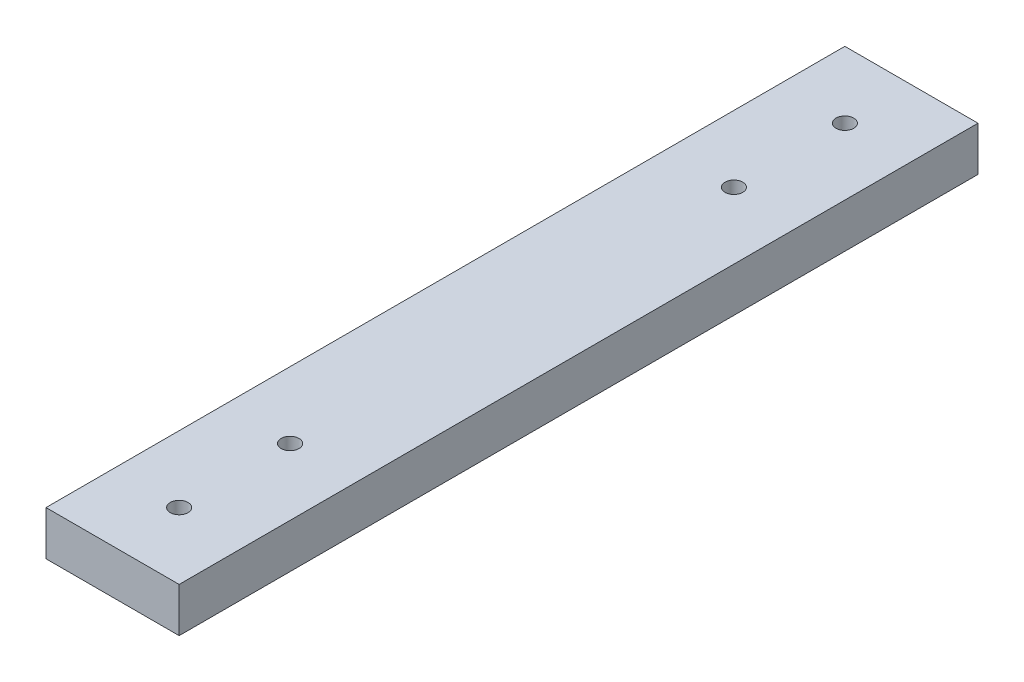
ISO-10303-21;
HEADER;
FILE_DESCRIPTION(('STEP AP214'),'2;1');
FILE_NAME('part.step','',(''),(''),'','','');
FILE_SCHEMA(('AUTOMOTIVE_DESIGN { 1 0 10303 214 1 1 1 1 }'));
ENDSEC;
DATA;
#1=APPLICATION_CONTEXT('core data for automotive mechanical design processes');
#2=APPLICATION_PROTOCOL_DEFINITION('international standard','automotive_design',2000,#1);
#3=PRODUCT_CONTEXT('',#1,'mechanical');
#4=PRODUCT('Part','Part','',(#3));
#5=PRODUCT_RELATED_PRODUCT_CATEGORY('part','',(#4));
#6=PRODUCT_DEFINITION_FORMATION('','',#4);
#7=PRODUCT_DEFINITION_CONTEXT('part definition',#1,'design');
#8=PRODUCT_DEFINITION('design','',#6,#7);
#9=PRODUCT_DEFINITION_SHAPE('','',#8);
#10=(LENGTH_UNIT() NAMED_UNIT(*) SI_UNIT(.MILLI.,.METRE.));
#11=(NAMED_UNIT(*) PLANE_ANGLE_UNIT() SI_UNIT($,.RADIAN.));
#12=(NAMED_UNIT(*) SI_UNIT($,.STERADIAN.) SOLID_ANGLE_UNIT());
#13=UNCERTAINTY_MEASURE_WITH_UNIT(LENGTH_MEASURE(1.E-05),#10,'distance_accuracy_value','');
#14=(GEOMETRIC_REPRESENTATION_CONTEXT(3) GLOBAL_UNCERTAINTY_ASSIGNED_CONTEXT((#13)) GLOBAL_UNIT_ASSIGNED_CONTEXT((#10,
#11,#12)) REPRESENTATION_CONTEXT('',''));
#15=CARTESIAN_POINT('',(0.,0.,0.));
#16=DIRECTION('',(0.,0.,1.));
#17=DIRECTION('',(1.,0.,0.));
#18=AXIS2_PLACEMENT_3D('',#15,#16,#17);
#19=CARTESIAN_POINT('',(0.,10.,0.));
#20=DIRECTION('',(0.,-1.,0.));
#21=DIRECTION('',(0.,0.,-1.));
#22=AXIS2_PLACEMENT_3D('',#19,#20,#21);
#23=PLANE('',#22);
#24=DIRECTION('',(0.,0.,1.));
#25=VECTOR('',#24,1.);
#26=CARTESIAN_POINT('',(0.,10.,0.));
#27=LINE('',#26,#25);
#28=CARTESIAN_POINT('',(0.,10.,-180.));
#29=VERTEX_POINT('',#28);
#30=CARTESIAN_POINT('',(0.,10.,0.));
#31=VERTEX_POINT('',#30);
#32=EDGE_CURVE('E88',#29,#31,#27,.T.);
#33=ORIENTED_EDGE('',*,*,#32,.T.);
#34=DIRECTION('',(1.,0.,0.));
#35=VECTOR('',#34,1.);
#36=CARTESIAN_POINT('',(0.,10.,0.));
#37=LINE('',#36,#35);
#38=CARTESIAN_POINT('',(30.,10.,0.));
#39=VERTEX_POINT('',#38);
#40=EDGE_CURVE('E83',#31,#39,#37,.T.);
#41=ORIENTED_EDGE('',*,*,#40,.T.);
#42=DIRECTION('',(0.,0.,-1.));
#43=VECTOR('',#42,1.);
#44=CARTESIAN_POINT('',(30.,10.,0.));
#45=LINE('',#44,#43);
#46=CARTESIAN_POINT('',(30.,10.,-180.));
#47=VERTEX_POINT('',#46);
#48=EDGE_CURVE('E86',#39,#47,#45,.T.);
#49=ORIENTED_EDGE('',*,*,#48,.T.);
#50=DIRECTION('',(-1.,0.,0.));
#51=VECTOR('',#50,1.);
#52=CARTESIAN_POINT('',(0.,10.,-180.));
#53=LINE('',#52,#51);
#54=EDGE_CURVE('E53',#47,#29,#53,.T.);
#55=ORIENTED_EDGE('',*,*,#54,.T.);
#56=EDGE_LOOP('',(#33,#41,#49,#55));
#57=FACE_BOUND('',#56,.T.);
#58=CARTESIAN_POINT('',(15.,10.,-140.));
#59=DIRECTION('',(0.,1.,0.));
#60=DIRECTION('',(0.,0.,1.));
#61=AXIS2_PLACEMENT_3D('',#58,#59,#60);
#62=CIRCLE('',#61,2.);
#63=CARTESIAN_POINT('',(15.,10.,-138.));
#64=VERTEX_POINT('',#63);
#65=EDGE_CURVE('E103',#64,#64,#62,.T.);
#66=ORIENTED_EDGE('',*,*,#65,.F.);
#67=EDGE_LOOP('',(#66));
#68=FACE_BOUND('',#67,.T.);
#69=CARTESIAN_POINT('',(15.,10.,-15.));
#70=DIRECTION('',(0.,1.,0.));
#71=DIRECTION('',(0.,0.,1.));
#72=AXIS2_PLACEMENT_3D('',#69,#70,#71);
#73=CIRCLE('',#72,2.);
#74=CARTESIAN_POINT('',(15.,10.,-13.));
#75=VERTEX_POINT('',#74);
#76=EDGE_CURVE('E118',#75,#75,#73,.T.);
#77=ORIENTED_EDGE('',*,*,#76,.F.);
#78=EDGE_LOOP('',(#77));
#79=FACE_BOUND('',#78,.T.);
#80=CARTESIAN_POINT('',(15.,10.,-40.));
#81=DIRECTION('',(0.,1.,0.));
#82=DIRECTION('',(0.,0.,1.));
#83=AXIS2_PLACEMENT_3D('',#80,#81,#82);
#84=CIRCLE('',#83,2.);
#85=CARTESIAN_POINT('',(15.,10.,-38.));
#86=VERTEX_POINT('',#85);
#87=EDGE_CURVE('E124',#86,#86,#84,.T.);
#88=ORIENTED_EDGE('',*,*,#87,.F.);
#89=EDGE_LOOP('',(#88));
#90=FACE_BOUND('',#89,.T.);
#91=CARTESIAN_POINT('',(15.,10.,-165.));
#92=DIRECTION('',(0.,1.,0.));
#93=DIRECTION('',(0.,0.,1.));
#94=AXIS2_PLACEMENT_3D('',#91,#92,#93);
#95=CIRCLE('',#94,2.);
#96=CARTESIAN_POINT('',(15.,10.,-163.));
#97=VERTEX_POINT('',#96);
#98=EDGE_CURVE('E130',#97,#97,#95,.T.);
#99=ORIENTED_EDGE('',*,*,#98,.F.);
#100=EDGE_LOOP('',(#99));
#101=FACE_BOUND('',#100,.T.);
#102=ADVANCED_FACE('F36',(#57,#68,#79,#90,#101),#23,.F.);
#103=CARTESIAN_POINT('',(0.,0.,0.));
#104=DIRECTION('',(0.,-1.,0.));
#105=DIRECTION('',(0.,0.,-1.));
#106=AXIS2_PLACEMENT_3D('',#103,#104,#105);
#107=PLANE('',#106);
#108=CARTESIAN_POINT('',(15.,0.,-40.));
#109=DIRECTION('',(0.,1.,0.));
#110=DIRECTION('',(0.,0.,1.));
#111=AXIS2_PLACEMENT_3D('',#108,#109,#110);
#112=CIRCLE('',#111,2.);
#113=CARTESIAN_POINT('',(15.,0.,-38.));
#114=VERTEX_POINT('',#113);
#115=EDGE_CURVE('E127',#114,#114,#112,.T.);
#116=ORIENTED_EDGE('',*,*,#115,.T.);
#117=EDGE_LOOP('',(#116));
#118=FACE_BOUND('',#117,.T.);
#119=CARTESIAN_POINT('',(15.,0.,-140.));
#120=DIRECTION('',(0.,1.,0.));
#121=DIRECTION('',(0.,0.,1.));
#122=AXIS2_PLACEMENT_3D('',#119,#120,#121);
#123=CIRCLE('',#122,2.);
#124=CARTESIAN_POINT('',(15.,0.,-138.));
#125=VERTEX_POINT('',#124);
#126=EDGE_CURVE('E115',#125,#125,#123,.T.);
#127=ORIENTED_EDGE('',*,*,#126,.T.);
#128=EDGE_LOOP('',(#127));
#129=FACE_BOUND('',#128,.T.);
#130=DIRECTION('',(0.,0.,1.));
#131=VECTOR('',#130,1.);
#132=CARTESIAN_POINT('',(0.,0.,0.));
#133=LINE('',#132,#131);
#134=CARTESIAN_POINT('',(0.,0.,-180.));
#135=VERTEX_POINT('',#134);
#136=CARTESIAN_POINT('',(0.,0.,0.));
#137=VERTEX_POINT('',#136);
#138=EDGE_CURVE('E100',#135,#137,#133,.T.);
#139=ORIENTED_EDGE('',*,*,#138,.F.);
#140=DIRECTION('',(-1.,0.,0.));
#141=VECTOR('',#140,1.);
#142=CARTESIAN_POINT('',(0.,0.,-180.));
#143=LINE('',#142,#141);
#144=CARTESIAN_POINT('',(30.,0.,-180.));
#145=VERTEX_POINT('',#144);
#146=EDGE_CURVE('E76',#145,#135,#143,.T.);
#147=ORIENTED_EDGE('',*,*,#146,.F.);
#148=DIRECTION('',(0.,0.,-1.));
#149=VECTOR('',#148,1.);
#150=CARTESIAN_POINT('',(30.,0.,0.));
#151=LINE('',#150,#149);
#152=CARTESIAN_POINT('',(30.,0.,0.));
#153=VERTEX_POINT('',#152);
#154=EDGE_CURVE('E70',#153,#145,#151,.T.);
#155=ORIENTED_EDGE('',*,*,#154,.F.);
#156=DIRECTION('',(1.,0.,0.));
#157=VECTOR('',#156,1.);
#158=CARTESIAN_POINT('',(0.,0.,0.));
#159=LINE('',#158,#157);
#160=EDGE_CURVE('E92',#137,#153,#159,.T.);
#161=ORIENTED_EDGE('',*,*,#160,.F.);
#162=EDGE_LOOP('',(#139,#147,#155,#161));
#163=FACE_BOUND('',#162,.T.);
#164=CARTESIAN_POINT('',(15.,0.,-15.));
#165=DIRECTION('',(0.,1.,0.));
#166=DIRECTION('',(0.,0.,1.));
#167=AXIS2_PLACEMENT_3D('',#164,#165,#166);
#168=CIRCLE('',#167,2.);
#169=CARTESIAN_POINT('',(15.,0.,-13.));
#170=VERTEX_POINT('',#169);
#171=EDGE_CURVE('E121',#170,#170,#168,.T.);
#172=ORIENTED_EDGE('',*,*,#171,.T.);
#173=EDGE_LOOP('',(#172));
#174=FACE_BOUND('',#173,.T.);
#175=CARTESIAN_POINT('',(15.,0.,-165.));
#176=DIRECTION('',(0.,1.,0.));
#177=DIRECTION('',(0.,0.,1.));
#178=AXIS2_PLACEMENT_3D('',#175,#176,#177);
#179=CIRCLE('',#178,2.);
#180=CARTESIAN_POINT('',(15.,0.,-163.));
#181=VERTEX_POINT('',#180);
#182=EDGE_CURVE('E133',#181,#181,#179,.T.);
#183=ORIENTED_EDGE('',*,*,#182,.T.);
#184=EDGE_LOOP('',(#183));
#185=FACE_BOUND('',#184,.T.);
#186=ADVANCED_FACE('F111',(#118,#129,#163,#174,#185),#107,.T.);
#187=CARTESIAN_POINT('',(0.,10.,0.));
#188=DIRECTION('',(1.,0.,0.));
#189=DIRECTION('',(0.,0.,-1.));
#190=AXIS2_PLACEMENT_3D('',#187,#188,#189);
#191=PLANE('',#190);
#192=ORIENTED_EDGE('',*,*,#138,.T.);
#193=DIRECTION('',(0.,-1.,0.));
#194=VECTOR('',#193,1.);
#195=CARTESIAN_POINT('',(0.,10.,0.));
#196=LINE('',#195,#194);
#197=EDGE_CURVE('E11',#31,#137,#196,.T.);
#198=ORIENTED_EDGE('',*,*,#197,.F.);
#199=ORIENTED_EDGE('',*,*,#32,.F.);
#200=DIRECTION('',(0.,-1.,0.));
#201=VECTOR('',#200,1.);
#202=CARTESIAN_POINT('',(0.,10.,-180.));
#203=LINE('',#202,#201);
#204=EDGE_CURVE('E96',#29,#135,#203,.T.);
#205=ORIENTED_EDGE('',*,*,#204,.T.);
#206=EDGE_LOOP('',(#192,#198,#199,#205));
#207=FACE_BOUND('',#206,.T.);
#208=ADVANCED_FACE('F38',(#207),#191,.F.);
#209=CARTESIAN_POINT('',(0.,10.,0.));
#210=DIRECTION('',(0.,0.,-1.));
#211=DIRECTION('',(-1.,0.,0.));
#212=AXIS2_PLACEMENT_3D('',#209,#210,#211);
#213=PLANE('',#212);
#214=ORIENTED_EDGE('',*,*,#160,.T.);
#215=DIRECTION('',(0.,-1.,0.));
#216=VECTOR('',#215,1.);
#217=CARTESIAN_POINT('',(30.,10.,0.));
#218=LINE('',#217,#216);
#219=EDGE_CURVE('E45',#39,#153,#218,.T.);
#220=ORIENTED_EDGE('',*,*,#219,.F.);
#221=ORIENTED_EDGE('',*,*,#40,.F.);
#222=ORIENTED_EDGE('',*,*,#197,.T.);
#223=EDGE_LOOP('',(#214,#220,#221,#222));
#224=FACE_BOUND('',#223,.T.);
#225=ADVANCED_FACE('F91',(#224),#213,.F.);
#226=CARTESIAN_POINT('',(30.,10.,0.));
#227=DIRECTION('',(-1.,0.,0.));
#228=DIRECTION('',(0.,0.,1.));
#229=AXIS2_PLACEMENT_3D('',#226,#227,#228);
#230=PLANE('',#229);
#231=ORIENTED_EDGE('',*,*,#154,.T.);
#232=DIRECTION('',(0.,-1.,0.));
#233=VECTOR('',#232,1.);
#234=CARTESIAN_POINT('',(30.,10.,-180.));
#235=LINE('',#234,#233);
#236=EDGE_CURVE('E93',#47,#145,#235,.T.);
#237=ORIENTED_EDGE('',*,*,#236,.F.);
#238=ORIENTED_EDGE('',*,*,#48,.F.);
#239=ORIENTED_EDGE('',*,*,#219,.T.);
#240=EDGE_LOOP('',(#231,#237,#238,#239));
#241=FACE_BOUND('',#240,.T.);
#242=ADVANCED_FACE('F94',(#241),#230,.F.);
#243=CARTESIAN_POINT('',(0.,10.,-180.));
#244=DIRECTION('',(0.,0.,1.));
#245=DIRECTION('',(1.,0.,0.));
#246=AXIS2_PLACEMENT_3D('',#243,#244,#245);
#247=PLANE('',#246);
#248=ORIENTED_EDGE('',*,*,#146,.T.);
#249=ORIENTED_EDGE('',*,*,#204,.F.);
#250=ORIENTED_EDGE('',*,*,#54,.F.);
#251=ORIENTED_EDGE('',*,*,#236,.T.);
#252=EDGE_LOOP('',(#248,#249,#250,#251));
#253=FACE_BOUND('',#252,.T.);
#254=ADVANCED_FACE('F108',(#253),#247,.F.);
#255=CARTESIAN_POINT('',(15.,10.,-140.));
#256=DIRECTION('',(0.,-1.,0.));
#257=DIRECTION('',(0.,0.,-1.));
#258=AXIS2_PLACEMENT_3D('',#255,#256,#257);
#259=CYLINDRICAL_SURFACE('',#258,2.);
#260=ORIENTED_EDGE('',*,*,#65,.T.);
#261=EDGE_LOOP('',(#260));
#262=FACE_BOUND('',#261,.T.);
#263=ORIENTED_EDGE('',*,*,#126,.F.);
#264=EDGE_LOOP('',(#263));
#265=FACE_BOUND('',#264,.T.);
#266=ADVANCED_FACE('F150',(#262,#265),#259,.F.);
#267=CARTESIAN_POINT('',(15.,10.,-15.));
#268=DIRECTION('',(0.,-1.,0.));
#269=DIRECTION('',(0.,0.,-1.));
#270=AXIS2_PLACEMENT_3D('',#267,#268,#269);
#271=CYLINDRICAL_SURFACE('',#270,2.);
#272=ORIENTED_EDGE('',*,*,#76,.T.);
#273=EDGE_LOOP('',(#272));
#274=FACE_BOUND('',#273,.T.);
#275=ORIENTED_EDGE('',*,*,#171,.F.);
#276=EDGE_LOOP('',(#275));
#277=FACE_BOUND('',#276,.T.);
#278=ADVANCED_FACE('F196',(#274,#277),#271,.F.);
#279=CARTESIAN_POINT('',(15.,10.,-40.));
#280=DIRECTION('',(0.,-1.,0.));
#281=DIRECTION('',(0.,0.,-1.));
#282=AXIS2_PLACEMENT_3D('',#279,#280,#281);
#283=CYLINDRICAL_SURFACE('',#282,2.);
#284=ORIENTED_EDGE('',*,*,#87,.T.);
#285=EDGE_LOOP('',(#284));
#286=FACE_BOUND('',#285,.T.);
#287=ORIENTED_EDGE('',*,*,#115,.F.);
#288=EDGE_LOOP('',(#287));
#289=FACE_BOUND('',#288,.T.);
#290=ADVANCED_FACE('F204',(#286,#289),#283,.F.);
#291=CARTESIAN_POINT('',(15.,10.,-165.));
#292=DIRECTION('',(0.,-1.,0.));
#293=DIRECTION('',(0.,0.,-1.));
#294=AXIS2_PLACEMENT_3D('',#291,#292,#293);
#295=CYLINDRICAL_SURFACE('',#294,2.);
#296=ORIENTED_EDGE('',*,*,#98,.T.);
#297=EDGE_LOOP('',(#296));
#298=FACE_BOUND('',#297,.T.);
#299=ORIENTED_EDGE('',*,*,#182,.F.);
#300=EDGE_LOOP('',(#299));
#301=FACE_BOUND('',#300,.T.);
#302=ADVANCED_FACE('F139',(#298,#301),#295,.F.);
#303=CLOSED_SHELL('',(#102,#186,#208,#225,#242,#254,#266,#278,#290,#302));
#304=MANIFOLD_SOLID_BREP('B2',#303);
#305=ADVANCED_BREP_SHAPE_REPRESENTATION('',(#18,#304),#14);
#306=SHAPE_DEFINITION_REPRESENTATION(#9,#305);
ENDSEC;
END-ISO-10303-21;
